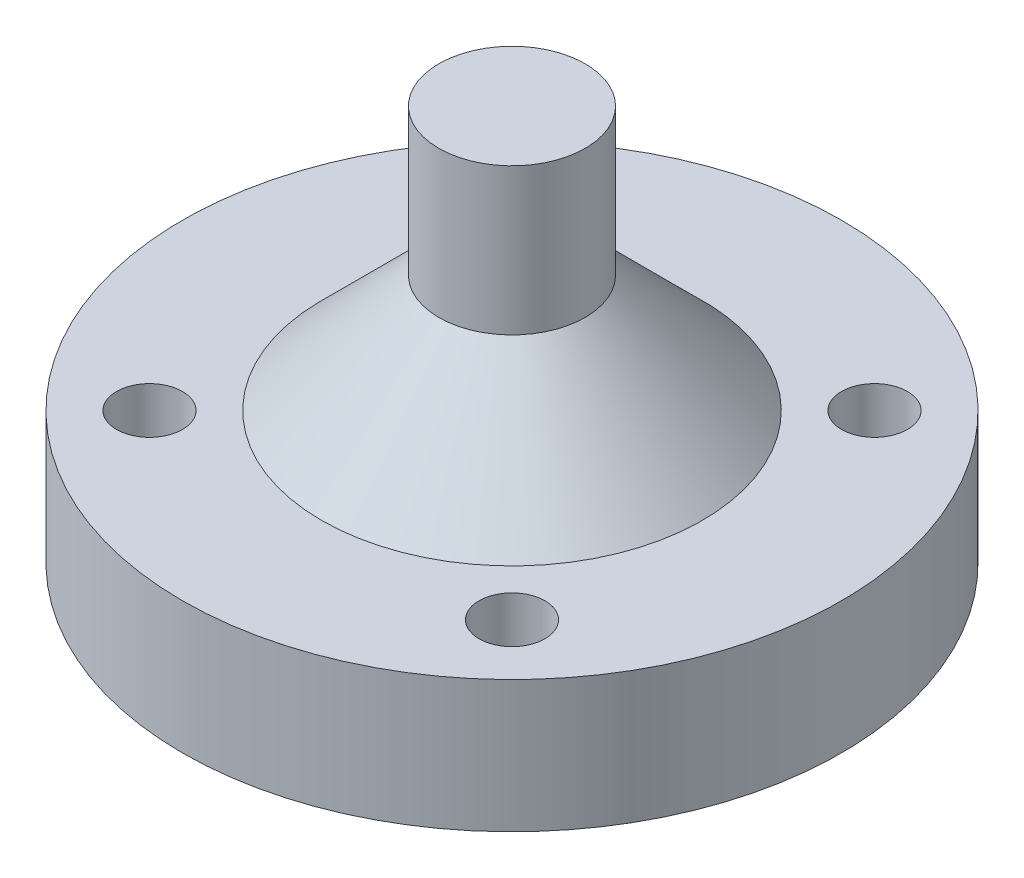
ISO-10303-21;
HEADER;
FILE_DESCRIPTION(('STEP AP214'),'2;1');
FILE_NAME('part.step','',(''),(''),'','','');
FILE_SCHEMA(('AUTOMOTIVE_DESIGN { 1 0 10303 214 1 1 1 1 }'));
ENDSEC;
DATA;
#1=APPLICATION_CONTEXT('core data for automotive mechanical design processes');
#2=APPLICATION_PROTOCOL_DEFINITION('international standard','automotive_design',2000,#1);
#3=PRODUCT_CONTEXT('',#1,'mechanical');
#4=PRODUCT('Part','Part','',(#3));
#5=PRODUCT_RELATED_PRODUCT_CATEGORY('part','',(#4));
#6=PRODUCT_DEFINITION_FORMATION('','',#4);
#7=PRODUCT_DEFINITION_CONTEXT('part definition',#1,'design');
#8=PRODUCT_DEFINITION('design','',#6,#7);
#9=PRODUCT_DEFINITION_SHAPE('','',#8);
#10=(LENGTH_UNIT() NAMED_UNIT(*) SI_UNIT(.MILLI.,.METRE.));
#11=(NAMED_UNIT(*) PLANE_ANGLE_UNIT() SI_UNIT($,.RADIAN.));
#12=(NAMED_UNIT(*) SI_UNIT($,.STERADIAN.) SOLID_ANGLE_UNIT());
#13=UNCERTAINTY_MEASURE_WITH_UNIT(LENGTH_MEASURE(1.E-05),#10,'distance_accuracy_value','');
#14=(GEOMETRIC_REPRESENTATION_CONTEXT(3) GLOBAL_UNCERTAINTY_ASSIGNED_CONTEXT((#13)) GLOBAL_UNIT_ASSIGNED_CONTEXT((#10,
#11,#12)) REPRESENTATION_CONTEXT('',''));
#15=CARTESIAN_POINT('',(0.,0.,0.));
#16=DIRECTION('',(0.,0.,1.));
#17=DIRECTION('',(1.,0.,0.));
#18=AXIS2_PLACEMENT_3D('',#15,#16,#17);
#19=CARTESIAN_POINT('',(0.,9.,0.));
#20=DIRECTION('',(0.,-1.,0.));
#21=DIRECTION('',(0.,0.,-1.));
#22=AXIS2_PLACEMENT_3D('',#19,#20,#21);
#23=CYLINDRICAL_SURFACE('',#22,22.5);
#24=CARTESIAN_POINT('',(0.,9.,0.));
#25=DIRECTION('',(0.,1.,0.));
#26=DIRECTION('',(0.,0.,1.));
#27=AXIS2_PLACEMENT_3D('',#24,#25,#26);
#28=CIRCLE('',#27,22.5);
#29=CARTESIAN_POINT('',(0.,9.,22.5));
#30=VERTEX_POINT('',#29);
#31=EDGE_CURVE('E50',#30,#30,#28,.T.);
#32=ORIENTED_EDGE('',*,*,#31,.F.);
#33=EDGE_LOOP('',(#32));
#34=FACE_BOUND('',#33,.T.);
#35=CARTESIAN_POINT('',(0.,0.,0.));
#36=DIRECTION('',(0.,1.,0.));
#37=DIRECTION('',(0.,0.,1.));
#38=AXIS2_PLACEMENT_3D('',#35,#36,#37);
#39=CIRCLE('',#38,22.5);
#40=CARTESIAN_POINT('',(0.,0.,22.5));
#41=VERTEX_POINT('',#40);
#42=EDGE_CURVE('E55',#41,#41,#39,.T.);
#43=ORIENTED_EDGE('',*,*,#42,.T.);
#44=EDGE_LOOP('',(#43));
#45=FACE_BOUND('',#44,.T.);
#46=ADVANCED_FACE('F37',(#34,#45),#23,.T.);
#47=CARTESIAN_POINT('',(0.,9.,0.));
#48=DIRECTION('',(0.,1.,0.));
#49=DIRECTION('',(0.,0.,1.));
#50=AXIS2_PLACEMENT_3D('',#47,#48,#49);
#51=PLANE('',#50);
#52=CARTESIAN_POINT('',(0.,9.,0.));
#53=DIRECTION('',(0.,1.,0.));
#54=DIRECTION('',(0.,0.,1.));
#55=AXIS2_PLACEMENT_3D('',#52,#53,#54);
#56=CIRCLE('',#55,13.);
#57=CARTESIAN_POINT('',(0.,9.,13.));
#58=VERTEX_POINT('',#57);
#59=EDGE_CURVE('E10',#58,#58,#56,.F.);
#60=ORIENTED_EDGE('',*,*,#59,.T.);
#61=EDGE_LOOP('',(#60));
#62=FACE_BOUND('',#61,.T.);
#63=CARTESIAN_POINT('',(-12.3743686707647,9.,-12.3743686707645));
#64=DIRECTION('',(0.,1.,0.));
#65=DIRECTION('',(1.,0.,0.));
#66=AXIS2_PLACEMENT_3D('',#63,#64,#65);
#67=CIRCLE('',#66,2.25);
#68=CARTESIAN_POINT('',(-10.1243686707647,9.,-12.3743686707645));
#69=VERTEX_POINT('',#68);
#70=EDGE_CURVE('E87',#69,#69,#67,.T.);
#71=ORIENTED_EDGE('',*,*,#70,.F.);
#72=EDGE_LOOP('',(#71));
#73=FACE_BOUND('',#72,.T.);
#74=CARTESIAN_POINT('',(-12.3743686707646,9.,12.3743686707646));
#75=DIRECTION('',(0.,1.,0.));
#76=DIRECTION('',(0.,0.,-1.));
#77=AXIS2_PLACEMENT_3D('',#74,#75,#76);
#78=CIRCLE('',#77,2.25);
#79=CARTESIAN_POINT('',(-12.3743686707646,9.,10.1243686707646));
#80=VERTEX_POINT('',#79);
#81=EDGE_CURVE('E79',#80,#80,#78,.T.);
#82=ORIENTED_EDGE('',*,*,#81,.F.);
#83=EDGE_LOOP('',(#82));
#84=FACE_BOUND('',#83,.T.);
#85=CARTESIAN_POINT('',(12.3743686707647,9.,12.3743686707644));
#86=DIRECTION('',(0.,1.,0.));
#87=DIRECTION('',(-1.,0.,0.));
#88=AXIS2_PLACEMENT_3D('',#85,#86,#87);
#89=CIRCLE('',#88,2.25);
#90=CARTESIAN_POINT('',(10.1243686707647,9.,12.3743686707645));
#91=VERTEX_POINT('',#90);
#92=EDGE_CURVE('E70',#91,#91,#89,.T.);
#93=ORIENTED_EDGE('',*,*,#92,.F.);
#94=EDGE_LOOP('',(#93));
#95=FACE_BOUND('',#94,.T.);
#96=CARTESIAN_POINT('',(12.3743686707646,9.,-12.3743686707646));
#97=DIRECTION('',(0.,1.,0.));
#98=DIRECTION('',(0.,0.,1.));
#99=AXIS2_PLACEMENT_3D('',#96,#97,#98);
#100=CIRCLE('',#99,2.25);
#101=CARTESIAN_POINT('',(12.3743686707646,9.,-10.1243686707646));
#102=VERTEX_POINT('',#101);
#103=EDGE_CURVE('E62',#102,#102,#100,.T.);
#104=ORIENTED_EDGE('',*,*,#103,.F.);
#105=EDGE_LOOP('',(#104));
#106=FACE_BOUND('',#105,.T.);
#107=ORIENTED_EDGE('',*,*,#31,.T.);
#108=EDGE_LOOP('',(#107));
#109=FACE_BOUND('',#108,.T.);
#110=ADVANCED_FACE('F118',(#62,#73,#84,#95,#106,#109),#51,.T.);
#111=CARTESIAN_POINT('',(0.,0.,0.));
#112=DIRECTION('',(0.,1.,0.));
#113=DIRECTION('',(0.,0.,1.));
#114=AXIS2_PLACEMENT_3D('',#111,#112,#113);
#115=PLANE('',#114);
#116=CARTESIAN_POINT('',(0.,0.,0.));
#117=DIRECTION('',(0.,-1.,0.));
#118=DIRECTION('',(0.,0.,-1.));
#119=AXIS2_PLACEMENT_3D('',#116,#117,#118);
#120=CIRCLE('',#119,10.75);
#121=CARTESIAN_POINT('',(0.,0.,-10.75));
#122=VERTEX_POINT('',#121);
#123=EDGE_CURVE('E98',#122,#122,#120,.T.);
#124=ORIENTED_EDGE('',*,*,#123,.F.);
#125=EDGE_LOOP('',(#124));
#126=FACE_BOUND('',#125,.T.);
#127=CARTESIAN_POINT('',(-12.3743686707647,0.,-12.3743686707645));
#128=DIRECTION('',(0.,1.,0.));
#129=DIRECTION('',(1.,0.,0.));
#130=AXIS2_PLACEMENT_3D('',#127,#128,#129);
#131=CIRCLE('',#130,2.25);
#132=CARTESIAN_POINT('',(-10.1243686707647,0.,-12.3743686707645));
#133=VERTEX_POINT('',#132);
#134=EDGE_CURVE('E66',#133,#133,#131,.T.);
#135=ORIENTED_EDGE('',*,*,#134,.T.);
#136=EDGE_LOOP('',(#135));
#137=FACE_BOUND('',#136,.T.);
#138=CARTESIAN_POINT('',(-12.3743686707646,0.,12.3743686707646));
#139=DIRECTION('',(0.,1.,0.));
#140=DIRECTION('',(0.,0.,-1.));
#141=AXIS2_PLACEMENT_3D('',#138,#139,#140);
#142=CIRCLE('',#141,2.25);
#143=CARTESIAN_POINT('',(-12.3743686707646,0.,10.1243686707646));
#144=VERTEX_POINT('',#143);
#145=EDGE_CURVE('E83',#144,#144,#142,.T.);
#146=ORIENTED_EDGE('',*,*,#145,.T.);
#147=EDGE_LOOP('',(#146));
#148=FACE_BOUND('',#147,.T.);
#149=CARTESIAN_POINT('',(12.3743686707647,0.,12.3743686707644));
#150=DIRECTION('',(0.,1.,0.));
#151=DIRECTION('',(-1.,0.,0.));
#152=AXIS2_PLACEMENT_3D('',#149,#150,#151);
#153=CIRCLE('',#152,2.25);
#154=CARTESIAN_POINT('',(10.1243686707647,0.,12.3743686707645));
#155=VERTEX_POINT('',#154);
#156=EDGE_CURVE('E74',#155,#155,#153,.T.);
#157=ORIENTED_EDGE('',*,*,#156,.T.);
#158=EDGE_LOOP('',(#157));
#159=FACE_BOUND('',#158,.T.);
#160=CARTESIAN_POINT('',(12.3743686707646,0.,-12.3743686707646));
#161=DIRECTION('',(0.,1.,0.));
#162=DIRECTION('',(0.,0.,1.));
#163=AXIS2_PLACEMENT_3D('',#160,#161,#162);
#164=CIRCLE('',#163,2.25);
#165=CARTESIAN_POINT('',(12.3743686707646,0.,-10.1243686707646));
#166=VERTEX_POINT('',#165);
#167=EDGE_CURVE('E60',#166,#166,#164,.T.);
#168=ORIENTED_EDGE('',*,*,#167,.T.);
#169=EDGE_LOOP('',(#168));
#170=FACE_BOUND('',#169,.T.);
#171=ORIENTED_EDGE('',*,*,#42,.F.);
#172=EDGE_LOOP('',(#171));
#173=FACE_BOUND('',#172,.T.);
#174=ADVANCED_FACE('F114',(#126,#137,#148,#159,#170,#173),#115,.F.);
#175=CARTESIAN_POINT('',(12.3743686707646,0.,-12.3743686707646));
#176=DIRECTION('',(0.,1.,0.));
#177=DIRECTION('',(0.,0.,1.));
#178=AXIS2_PLACEMENT_3D('',#175,#176,#177);
#179=CYLINDRICAL_SURFACE('',#178,2.25);
#180=ORIENTED_EDGE('',*,*,#167,.F.);
#181=EDGE_LOOP('',(#180));
#182=FACE_BOUND('',#181,.T.);
#183=ORIENTED_EDGE('',*,*,#103,.T.);
#184=EDGE_LOOP('',(#183));
#185=FACE_BOUND('',#184,.T.);
#186=ADVANCED_FACE('F117',(#182,#185),#179,.F.);
#187=CARTESIAN_POINT('',(12.3743686707647,0.,12.3743686707644));
#188=DIRECTION('',(0.,1.,0.));
#189=DIRECTION('',(0.,0.,1.));
#190=AXIS2_PLACEMENT_3D('',#187,#188,#189);
#191=CYLINDRICAL_SURFACE('',#190,2.25);
#192=ORIENTED_EDGE('',*,*,#156,.F.);
#193=EDGE_LOOP('',(#192));
#194=FACE_BOUND('',#193,.T.);
#195=ORIENTED_EDGE('',*,*,#92,.T.);
#196=EDGE_LOOP('',(#195));
#197=FACE_BOUND('',#196,.T.);
#198=ADVANCED_FACE('F140',(#194,#197),#191,.F.);
#199=CARTESIAN_POINT('',(-12.3743686707646,0.,12.3743686707646));
#200=DIRECTION('',(0.,1.,0.));
#201=DIRECTION('',(0.,0.,1.));
#202=AXIS2_PLACEMENT_3D('',#199,#200,#201);
#203=CYLINDRICAL_SURFACE('',#202,2.25);
#204=ORIENTED_EDGE('',*,*,#145,.F.);
#205=EDGE_LOOP('',(#204));
#206=FACE_BOUND('',#205,.T.);
#207=ORIENTED_EDGE('',*,*,#81,.T.);
#208=EDGE_LOOP('',(#207));
#209=FACE_BOUND('',#208,.T.);
#210=ADVANCED_FACE('F144',(#206,#209),#203,.F.);
#211=CARTESIAN_POINT('',(-12.3743686707647,0.,-12.3743686707645));
#212=DIRECTION('',(0.,1.,0.));
#213=DIRECTION('',(0.,0.,1.));
#214=AXIS2_PLACEMENT_3D('',#211,#212,#213);
#215=CYLINDRICAL_SURFACE('',#214,2.25);
#216=ORIENTED_EDGE('',*,*,#134,.F.);
#217=EDGE_LOOP('',(#216));
#218=FACE_BOUND('',#217,.T.);
#219=ORIENTED_EDGE('',*,*,#70,.T.);
#220=EDGE_LOOP('',(#219));
#221=FACE_BOUND('',#220,.T.);
#222=ADVANCED_FACE('F148',(#218,#221),#215,.F.);
#223=CARTESIAN_POINT('',(0.,27.,0.));
#224=DIRECTION('',(0.,-1.,0.));
#225=DIRECTION('',(0.,0.,-1.));
#226=AXIS2_PLACEMENT_3D('',#223,#224,#225);
#227=CYLINDRICAL_SURFACE('',#226,5.);
#228=CARTESIAN_POINT('',(0.,17.,0.));
#229=DIRECTION('',(0.,1.,0.));
#230=DIRECTION('',(0.,0.,1.));
#231=AXIS2_PLACEMENT_3D('',#228,#229,#230);
#232=CIRCLE('',#231,5.);
#233=CARTESIAN_POINT('',(0.,17.,5.));
#234=VERTEX_POINT('',#233);
#235=EDGE_CURVE('E45',#234,#234,#232,.T.);
#236=ORIENTED_EDGE('',*,*,#235,.T.);
#237=EDGE_LOOP('',(#236));
#238=FACE_BOUND('',#237,.T.);
#239=CARTESIAN_POINT('',(0.,27.,0.));
#240=DIRECTION('',(0.,1.,0.));
#241=DIRECTION('',(0.,0.,1.));
#242=AXIS2_PLACEMENT_3D('',#239,#240,#241);
#243=CIRCLE('',#242,5.);
#244=CARTESIAN_POINT('',(0.,27.,5.));
#245=VERTEX_POINT('',#244);
#246=EDGE_CURVE('E75',#245,#245,#243,.T.);
#247=ORIENTED_EDGE('',*,*,#246,.F.);
#248=EDGE_LOOP('',(#247));
#249=FACE_BOUND('',#248,.T.);
#250=ADVANCED_FACE('F152',(#238,#249),#227,.T.);
#251=CARTESIAN_POINT('',(0.,27.,0.));
#252=DIRECTION('',(0.,1.,0.));
#253=DIRECTION('',(0.,0.,1.));
#254=AXIS2_PLACEMENT_3D('',#251,#252,#253);
#255=PLANE('',#254);
#256=ORIENTED_EDGE('',*,*,#246,.T.);
#257=EDGE_LOOP('',(#256));
#258=FACE_BOUND('',#257,.T.);
#259=ADVANCED_FACE('F156',(#258),#255,.T.);
#260=CARTESIAN_POINT('',(0.,17.,0.));
#261=DIRECTION('',(0.,-1.,0.));
#262=DIRECTION('',(0.,0.,-1.));
#263=AXIS2_PLACEMENT_3D('',#260,#261,#262);
#264=CONICAL_SURFACE('',#263,5.,0.785398163397443);
#265=ORIENTED_EDGE('',*,*,#59,.F.);
#266=EDGE_LOOP('',(#265));
#267=FACE_BOUND('',#266,.T.);
#268=ORIENTED_EDGE('',*,*,#235,.F.);
#269=EDGE_LOOP('',(#268));
#270=FACE_BOUND('',#269,.T.);
#271=ADVANCED_FACE('F39',(#267,#270),#264,.T.);
#272=CARTESIAN_POINT('',(0.,6.,0.));
#273=DIRECTION('',(0.,-1.,0.));
#274=DIRECTION('',(0.,0.,-1.));
#275=AXIS2_PLACEMENT_3D('',#272,#273,#274);
#276=CYLINDRICAL_SURFACE('',#275,10.75);
#277=CARTESIAN_POINT('',(0.,6.,0.));
#278=DIRECTION('',(0.,-1.,0.));
#279=DIRECTION('',(0.,0.,-1.));
#280=AXIS2_PLACEMENT_3D('',#277,#278,#279);
#281=CIRCLE('',#280,10.75);
#282=CARTESIAN_POINT('',(0.,6.,-10.75));
#283=VERTEX_POINT('',#282);
#284=EDGE_CURVE('E97',#283,#283,#281,.T.);
#285=ORIENTED_EDGE('',*,*,#284,.F.);
#286=EDGE_LOOP('',(#285));
#287=FACE_BOUND('',#286,.T.);
#288=ORIENTED_EDGE('',*,*,#123,.T.);
#289=EDGE_LOOP('',(#288));
#290=FACE_BOUND('',#289,.T.);
#291=ADVANCED_FACE('F108',(#287,#290),#276,.F.);
#292=CARTESIAN_POINT('',(0.,6.,0.));
#293=DIRECTION('',(0.,-1.,0.));
#294=DIRECTION('',(0.,0.,-1.));
#295=AXIS2_PLACEMENT_3D('',#292,#293,#294);
#296=PLANE('',#295);
#297=ORIENTED_EDGE('',*,*,#284,.T.);
#298=EDGE_LOOP('',(#297));
#299=FACE_BOUND('',#298,.T.);
#300=ADVANCED_FACE('F106',(#299),#296,.T.);
#301=CLOSED_SHELL('',(#46,#110,#174,#186,#198,#210,#222,#250,#259,#271,#291,#300));
#302=MANIFOLD_SOLID_BREP('B2',#301);
#303=ADVANCED_BREP_SHAPE_REPRESENTATION('',(#18,#302),#14);
#304=SHAPE_DEFINITION_REPRESENTATION(#9,#303);
ENDSEC;
END-ISO-10303-21;
